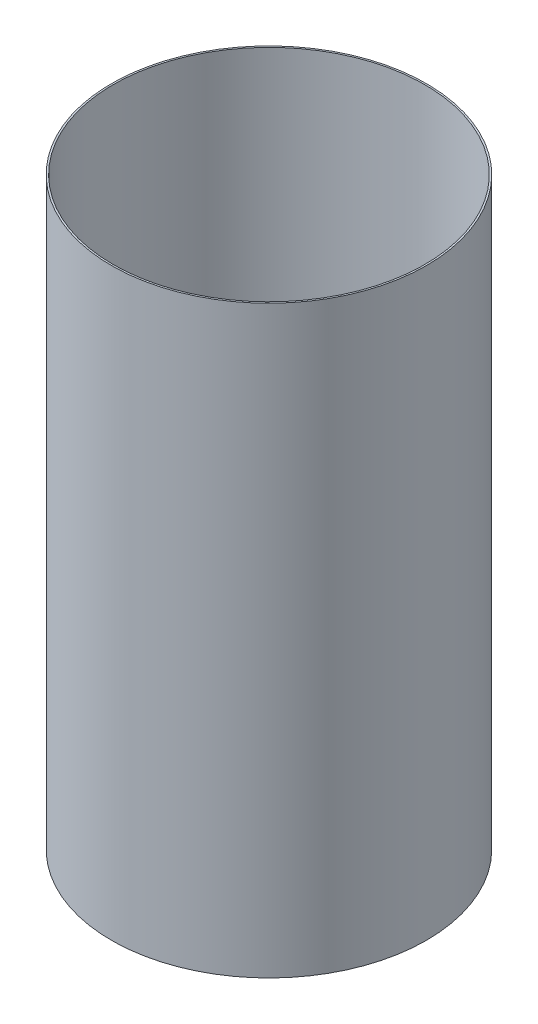
ISO-10303-21;
HEADER;
FILE_DESCRIPTION(('STEP AP214'),'2;1');
FILE_NAME('part.step','',(''),(''),'','','');
FILE_SCHEMA(('AUTOMOTIVE_DESIGN { 1 0 10303 214 1 1 1 1 }'));
ENDSEC;
DATA;
#1=APPLICATION_CONTEXT('core data for automotive mechanical design processes');
#2=APPLICATION_PROTOCOL_DEFINITION('international standard','automotive_design',2000,#1);
#3=PRODUCT_CONTEXT('',#1,'mechanical');
#4=PRODUCT('Part','Part','',(#3));
#5=PRODUCT_RELATED_PRODUCT_CATEGORY('part','',(#4));
#6=PRODUCT_DEFINITION_FORMATION('','',#4);
#7=PRODUCT_DEFINITION_CONTEXT('part definition',#1,'design');
#8=PRODUCT_DEFINITION('design','',#6,#7);
#9=PRODUCT_DEFINITION_SHAPE('','',#8);
#10=(LENGTH_UNIT() NAMED_UNIT(*) SI_UNIT(.MILLI.,.METRE.));
#11=(NAMED_UNIT(*) PLANE_ANGLE_UNIT() SI_UNIT($,.RADIAN.));
#12=(NAMED_UNIT(*) SI_UNIT($,.STERADIAN.) SOLID_ANGLE_UNIT());
#13=UNCERTAINTY_MEASURE_WITH_UNIT(LENGTH_MEASURE(1.E-05),#10,'distance_accuracy_value','');
#14=(GEOMETRIC_REPRESENTATION_CONTEXT(3) GLOBAL_UNCERTAINTY_ASSIGNED_CONTEXT((#13)) GLOBAL_UNIT_ASSIGNED_CONTEXT((#10,
#11,#12)) REPRESENTATION_CONTEXT('',''));
#15=CARTESIAN_POINT('',(0.,0.,0.));
#16=DIRECTION('',(0.,0.,1.));
#17=DIRECTION('',(1.,0.,0.));
#18=AXIS2_PLACEMENT_3D('',#15,#16,#17);
#19=CARTESIAN_POINT('',(0.,190.5,0.));
#20=DIRECTION('',(0.,1.,0.));
#21=DIRECTION('',(0.,0.,1.));
#22=AXIS2_PLACEMENT_3D('',#19,#20,#21);
#23=PLANE('',#22);
#24=CARTESIAN_POINT('',(0.,190.5,0.));
#25=DIRECTION('',(0.,1.,0.));
#26=DIRECTION('',(1.,0.,0.));
#27=AXIS2_PLACEMENT_3D('',#24,#25,#26);
#28=CIRCLE('',#27,51.3588);
#29=CARTESIAN_POINT('',(51.3588,190.5,0.));
#30=VERTEX_POINT('',#29);
#31=EDGE_CURVE('E11',#30,#30,#28,.T.);
#32=ORIENTED_EDGE('',*,*,#31,.T.);
#33=EDGE_LOOP('',(#32));
#34=FACE_BOUND('',#33,.T.);
#35=CARTESIAN_POINT('',(0.,190.5,0.));
#36=DIRECTION('',(0.,1.,0.));
#37=DIRECTION('',(0.,0.,1.));
#38=AXIS2_PLACEMENT_3D('',#35,#36,#37);
#39=CIRCLE('',#38,50.8);
#40=CARTESIAN_POINT('',(0.,190.5,50.8));
#41=VERTEX_POINT('',#40);
#42=EDGE_CURVE('E55',#41,#41,#39,.T.);
#43=ORIENTED_EDGE('',*,*,#42,.F.);
#44=EDGE_LOOP('',(#43));
#45=FACE_BOUND('',#44,.T.);
#46=ADVANCED_FACE('F41',(#34,#45),#23,.T.);
#47=CARTESIAN_POINT('',(0.,0.,0.));
#48=DIRECTION('',(0.,1.,0.));
#49=DIRECTION('',(0.,0.,1.));
#50=AXIS2_PLACEMENT_3D('',#47,#48,#49);
#51=PLANE('',#50);
#52=CARTESIAN_POINT('',(0.,0.,0.));
#53=DIRECTION('',(0.,1.,0.));
#54=DIRECTION('',(1.,0.,0.));
#55=AXIS2_PLACEMENT_3D('',#52,#53,#54);
#56=CIRCLE('',#55,51.3588);
#57=CARTESIAN_POINT('',(51.3588,0.,0.));
#58=VERTEX_POINT('',#57);
#59=EDGE_CURVE('E45',#58,#58,#56,.T.);
#60=ORIENTED_EDGE('',*,*,#59,.F.);
#61=EDGE_LOOP('',(#60));
#62=FACE_BOUND('',#61,.T.);
#63=CARTESIAN_POINT('',(0.,0.,0.));
#64=DIRECTION('',(0.,1.,0.));
#65=DIRECTION('',(0.,0.,1.));
#66=AXIS2_PLACEMENT_3D('',#63,#64,#65);
#67=CIRCLE('',#66,50.8);
#68=CARTESIAN_POINT('',(0.,0.,50.8));
#69=VERTEX_POINT('',#68);
#70=EDGE_CURVE('E57',#69,#69,#67,.T.);
#71=ORIENTED_EDGE('',*,*,#70,.T.);
#72=EDGE_LOOP('',(#71));
#73=FACE_BOUND('',#72,.T.);
#74=ADVANCED_FACE('F68',(#62,#73),#51,.F.);
#75=CARTESIAN_POINT('',(0.,190.5,0.));
#76=DIRECTION('',(0.,-1.,0.));
#77=DIRECTION('',(0.,0.,-1.));
#78=AXIS2_PLACEMENT_3D('',#75,#76,#77);
#79=CYLINDRICAL_SURFACE('',#78,51.3588);
#80=ORIENTED_EDGE('',*,*,#31,.F.);
#81=EDGE_LOOP('',(#80));
#82=FACE_BOUND('',#81,.T.);
#83=ORIENTED_EDGE('',*,*,#59,.T.);
#84=EDGE_LOOP('',(#83));
#85=FACE_BOUND('',#84,.T.);
#86=ADVANCED_FACE('F43',(#82,#85),#79,.T.);
#87=CARTESIAN_POINT('',(0.,190.5,0.));
#88=DIRECTION('',(0.,-1.,0.));
#89=DIRECTION('',(0.,0.,-1.));
#90=AXIS2_PLACEMENT_3D('',#87,#88,#89);
#91=CYLINDRICAL_SURFACE('',#90,50.8);
#92=ORIENTED_EDGE('',*,*,#42,.T.);
#93=EDGE_LOOP('',(#92));
#94=FACE_BOUND('',#93,.T.);
#95=ORIENTED_EDGE('',*,*,#70,.F.);
#96=EDGE_LOOP('',(#95));
#97=FACE_BOUND('',#96,.T.);
#98=ADVANCED_FACE('F64',(#94,#97),#91,.F.);
#99=CLOSED_SHELL('',(#46,#74,#86,#98));
#100=MANIFOLD_SOLID_BREP('B2',#99);
#101=ADVANCED_BREP_SHAPE_REPRESENTATION('',(#18,#100),#14);
#102=SHAPE_DEFINITION_REPRESENTATION(#9,#101);
ENDSEC;
END-ISO-10303-21;
